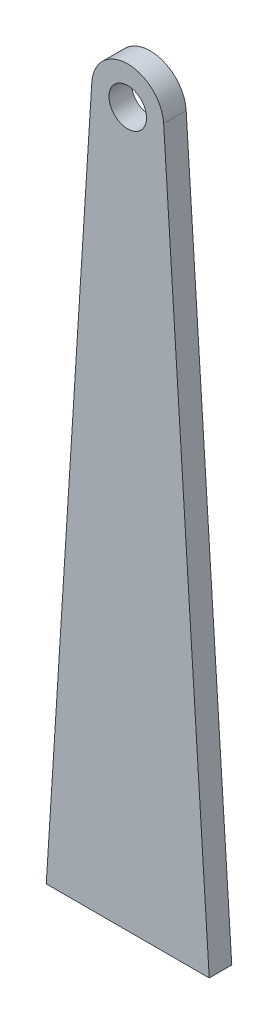
ISO-10303-21;
HEADER;
FILE_DESCRIPTION(('STEP AP214'),'2;1');
FILE_NAME('part.step','',(''),(''),'','','');
FILE_SCHEMA(('AUTOMOTIVE_DESIGN { 1 0 10303 214 1 1 1 1 }'));
ENDSEC;
DATA;
#1=APPLICATION_CONTEXT('core data for automotive mechanical design processes');
#2=APPLICATION_PROTOCOL_DEFINITION('international standard','automotive_design',2000,#1);
#3=PRODUCT_CONTEXT('',#1,'mechanical');
#4=PRODUCT('Part','Part','',(#3));
#5=PRODUCT_RELATED_PRODUCT_CATEGORY('part','',(#4));
#6=PRODUCT_DEFINITION_FORMATION('','',#4);
#7=PRODUCT_DEFINITION_CONTEXT('part definition',#1,'design');
#8=PRODUCT_DEFINITION('design','',#6,#7);
#9=PRODUCT_DEFINITION_SHAPE('','',#8);
#10=(LENGTH_UNIT() NAMED_UNIT(*) SI_UNIT(.MILLI.,.METRE.));
#11=(NAMED_UNIT(*) PLANE_ANGLE_UNIT() SI_UNIT($,.RADIAN.));
#12=(NAMED_UNIT(*) SI_UNIT($,.STERADIAN.) SOLID_ANGLE_UNIT());
#13=UNCERTAINTY_MEASURE_WITH_UNIT(LENGTH_MEASURE(1.E-05),#10,'distance_accuracy_value','');
#14=(GEOMETRIC_REPRESENTATION_CONTEXT(3) GLOBAL_UNCERTAINTY_ASSIGNED_CONTEXT((#13)) GLOBAL_UNIT_ASSIGNED_CONTEXT((#10,
#11,#12)) REPRESENTATION_CONTEXT('',''));
#15=CARTESIAN_POINT('',(0.,0.,0.));
#16=DIRECTION('',(0.,0.,1.));
#17=DIRECTION('',(1.,0.,0.));
#18=AXIS2_PLACEMENT_3D('',#15,#16,#17);
#19=CARTESIAN_POINT('',(0.,10.3024896690877,3.));
#20=DIRECTION('',(0.,0.,-1.));
#21=DIRECTION('',(-1.,0.,0.));
#22=AXIS2_PLACEMENT_3D('',#19,#20,#21);
#23=PLANE('',#22);
#24=DIRECTION('',(-0.0634393515273063,-0.997985695627846,0.));
#25=VECTOR('',#24,1.);
#26=CARTESIAN_POINT('',(-10.8535639513607,-84.9057582701911,3.));
#27=LINE('',#26,#25);
#28=CARTESIAN_POINT('',(-4.78210001359501,10.6064753124995,3.));
#29=VERTEX_POINT('',#28);
#30=CARTESIAN_POINT('',(-10.8535639513607,-84.9057582701911,3.));
#31=VERTEX_POINT('',#30);
#32=EDGE_CURVE('E86',#29,#31,#27,.T.);
#33=ORIENTED_EDGE('',*,*,#32,.T.);
#34=DIRECTION('',(1.,0.,0.));
#35=VECTOR('',#34,1.);
#36=CARTESIAN_POINT('',(10.8535639513607,-84.9057582701911,3.));
#37=LINE('',#36,#35);
#38=CARTESIAN_POINT('',(10.8535639513607,-84.9057582701911,3.));
#39=VERTEX_POINT('',#38);
#40=EDGE_CURVE('E80',#31,#39,#37,.T.);
#41=ORIENTED_EDGE('',*,*,#40,.T.);
#42=DIRECTION('',(-0.0634393515273063,0.997985695627846,0.));
#43=VECTOR('',#42,1.);
#44=CARTESIAN_POINT('',(10.8535639513607,-84.9057582701911,3.));
#45=LINE('',#44,#43);
#46=CARTESIAN_POINT('',(4.78210001359501,10.6064753124995,3.));
#47=VERTEX_POINT('',#46);
#48=EDGE_CURVE('E83',#39,#47,#45,.T.);
#49=ORIENTED_EDGE('',*,*,#48,.T.);
#50=CARTESIAN_POINT('',(0.,10.3024896690877,3.));
#51=DIRECTION('',(0.,0.,1.));
#52=DIRECTION('',(1.,0.,0.));
#53=AXIS2_PLACEMENT_3D('',#50,#51,#52);
#54=CIRCLE('',#53,4.7917520607212);
#55=EDGE_CURVE('E52',#47,#29,#54,.T.);
#56=ORIENTED_EDGE('',*,*,#55,.T.);
#57=EDGE_LOOP('',(#33,#41,#49,#56));
#58=FACE_BOUND('',#57,.T.);
#59=CARTESIAN_POINT('',(0.,10.0942417298089,3.));
#60=DIRECTION('',(0.,0.,1.));
#61=DIRECTION('',(1.,0.,0.));
#62=AXIS2_PLACEMENT_3D('',#59,#60,#61);
#63=CIRCLE('',#62,2.5);
#64=CARTESIAN_POINT('',(2.5,10.0942417298089,3.));
#65=VERTEX_POINT('',#64);
#66=EDGE_CURVE('E103',#65,#65,#63,.T.);
#67=ORIENTED_EDGE('',*,*,#66,.F.);
#68=EDGE_LOOP('',(#67));
#69=FACE_BOUND('',#68,.T.);
#70=ADVANCED_FACE('F35',(#58,#69),#23,.F.);
#71=CARTESIAN_POINT('',(0.,10.3024896690877,0.));
#72=DIRECTION('',(0.,0.,-1.));
#73=DIRECTION('',(-1.,0.,0.));
#74=AXIS2_PLACEMENT_3D('',#71,#72,#73);
#75=PLANE('',#74);
#76=DIRECTION('',(-0.0634393515273063,-0.997985695627846,0.));
#77=VECTOR('',#76,1.);
#78=CARTESIAN_POINT('',(-10.8535639513607,-84.9057582701911,0.));
#79=LINE('',#78,#77);
#80=CARTESIAN_POINT('',(-4.78210001359501,10.6064753124995,0.));
#81=VERTEX_POINT('',#80);
#82=CARTESIAN_POINT('',(-10.8535639513607,-84.9057582701911,0.));
#83=VERTEX_POINT('',#82);
#84=EDGE_CURVE('E100',#81,#83,#79,.T.);
#85=ORIENTED_EDGE('',*,*,#84,.F.);
#86=CARTESIAN_POINT('',(0.,10.3024896690877,0.));
#87=DIRECTION('',(0.,0.,1.));
#88=DIRECTION('',(-1.,0.,0.));
#89=AXIS2_PLACEMENT_3D('',#86,#87,#88);
#90=CIRCLE('',#89,4.7917520607212);
#91=CARTESIAN_POINT('',(4.78210001359501,10.6064753124995,0.));
#92=VERTEX_POINT('',#91);
#93=EDGE_CURVE('E69',#92,#81,#90,.T.);
#94=ORIENTED_EDGE('',*,*,#93,.F.);
#95=DIRECTION('',(-0.0634393515273063,0.997985695627846,0.));
#96=VECTOR('',#95,1.);
#97=CARTESIAN_POINT('',(10.8535639513607,-84.9057582701911,0.));
#98=LINE('',#97,#96);
#99=CARTESIAN_POINT('',(10.8535639513607,-84.9057582701911,0.));
#100=VERTEX_POINT('',#99);
#101=EDGE_CURVE('E105',#100,#92,#98,.T.);
#102=ORIENTED_EDGE('',*,*,#101,.F.);
#103=DIRECTION('',(1.,0.,0.));
#104=VECTOR('',#103,1.);
#105=CARTESIAN_POINT('',(10.8535639513607,-84.9057582701911,0.));
#106=LINE('',#105,#104);
#107=EDGE_CURVE('E91',#83,#100,#106,.T.);
#108=ORIENTED_EDGE('',*,*,#107,.F.);
#109=EDGE_LOOP('',(#85,#94,#102,#108));
#110=FACE_BOUND('',#109,.T.);
#111=CARTESIAN_POINT('',(0.,10.0942417298089,0.));
#112=DIRECTION('',(0.,0.,1.));
#113=DIRECTION('',(1.,0.,0.));
#114=AXIS2_PLACEMENT_3D('',#111,#112,#113);
#115=CIRCLE('',#114,2.5);
#116=CARTESIAN_POINT('',(2.5,10.0942417298089,0.));
#117=VERTEX_POINT('',#116);
#118=EDGE_CURVE('E112',#117,#117,#115,.T.);
#119=ORIENTED_EDGE('',*,*,#118,.T.);
#120=EDGE_LOOP('',(#119));
#121=FACE_BOUND('',#120,.T.);
#122=ADVANCED_FACE('F121',(#110,#121),#75,.T.);
#123=CARTESIAN_POINT('',(-10.8535639513607,-84.9057582701911,3.));
#124=DIRECTION('',(0.997985695627845,-0.0634393515273063,0.));
#125=DIRECTION('',(0.0634393515273063,0.997985695627846,0.));
#126=AXIS2_PLACEMENT_3D('',#123,#124,#125);
#127=PLANE('',#126);
#128=ORIENTED_EDGE('',*,*,#84,.T.);
#129=DIRECTION('',(0.,0.,-1.));
#130=VECTOR('',#129,1.);
#131=CARTESIAN_POINT('',(-10.8535639513607,-84.9057582701911,3.));
#132=LINE('',#131,#130);
#133=EDGE_CURVE('E11',#31,#83,#132,.T.);
#134=ORIENTED_EDGE('',*,*,#133,.F.);
#135=ORIENTED_EDGE('',*,*,#32,.F.);
#136=DIRECTION('',(0.,0.,-1.));
#137=VECTOR('',#136,1.);
#138=CARTESIAN_POINT('',(-4.78210001359501,10.6064753124995,3.));
#139=LINE('',#138,#137);
#140=EDGE_CURVE('E96',#29,#81,#139,.T.);
#141=ORIENTED_EDGE('',*,*,#140,.T.);
#142=EDGE_LOOP('',(#128,#134,#135,#141));
#143=FACE_BOUND('',#142,.T.);
#144=ADVANCED_FACE('F37',(#143),#127,.F.);
#145=CARTESIAN_POINT('',(10.8535639513607,-84.9057582701911,3.));
#146=DIRECTION('',(0.,1.,0.));
#147=DIRECTION('',(0.,0.,1.));
#148=AXIS2_PLACEMENT_3D('',#145,#146,#147);
#149=PLANE('',#148);
#150=ORIENTED_EDGE('',*,*,#107,.T.);
#151=DIRECTION('',(0.,0.,-1.));
#152=VECTOR('',#151,1.);
#153=CARTESIAN_POINT('',(10.8535639513607,-84.9057582701911,3.));
#154=LINE('',#153,#152);
#155=EDGE_CURVE('E44',#39,#100,#154,.T.);
#156=ORIENTED_EDGE('',*,*,#155,.F.);
#157=ORIENTED_EDGE('',*,*,#40,.F.);
#158=ORIENTED_EDGE('',*,*,#133,.T.);
#159=EDGE_LOOP('',(#150,#156,#157,#158));
#160=FACE_BOUND('',#159,.T.);
#161=ADVANCED_FACE('F90',(#160),#149,.F.);
#162=CARTESIAN_POINT('',(10.8535639513607,-84.9057582701911,3.));
#163=DIRECTION('',(-0.997985695627845,-0.0634393515273063,0.));
#164=DIRECTION('',(0.0634393515273063,-0.997985695627846,0.));
#165=AXIS2_PLACEMENT_3D('',#162,#163,#164);
#166=PLANE('',#165);
#167=ORIENTED_EDGE('',*,*,#101,.T.);
#168=DIRECTION('',(0.,0.,-1.));
#169=VECTOR('',#168,1.);
#170=CARTESIAN_POINT('',(4.78210001359501,10.6064753124995,3.));
#171=LINE('',#170,#169);
#172=EDGE_CURVE('E93',#47,#92,#171,.T.);
#173=ORIENTED_EDGE('',*,*,#172,.F.);
#174=ORIENTED_EDGE('',*,*,#48,.F.);
#175=ORIENTED_EDGE('',*,*,#155,.T.);
#176=EDGE_LOOP('',(#167,#173,#174,#175));
#177=FACE_BOUND('',#176,.T.);
#178=ADVANCED_FACE('F94',(#177),#166,.F.);
#179=CARTESIAN_POINT('',(0.,10.3024896690877,3.));
#180=DIRECTION('',(0.,0.,-1.));
#181=DIRECTION('',(-1.,0.,0.));
#182=AXIS2_PLACEMENT_3D('',#179,#180,#181);
#183=CYLINDRICAL_SURFACE('',#182,4.7917520607212);
#184=ORIENTED_EDGE('',*,*,#93,.T.);
#185=ORIENTED_EDGE('',*,*,#140,.F.);
#186=ORIENTED_EDGE('',*,*,#55,.F.);
#187=ORIENTED_EDGE('',*,*,#172,.T.);
#188=EDGE_LOOP('',(#184,#185,#186,#187));
#189=FACE_BOUND('',#188,.T.);
#190=ADVANCED_FACE('F109',(#189),#183,.T.);
#191=CARTESIAN_POINT('',(0.,10.0942417298089,3.));
#192=DIRECTION('',(0.,0.,-1.));
#193=DIRECTION('',(-1.,0.,0.));
#194=AXIS2_PLACEMENT_3D('',#191,#192,#193);
#195=CYLINDRICAL_SURFACE('',#194,2.5);
#196=ORIENTED_EDGE('',*,*,#66,.T.);
#197=EDGE_LOOP('',(#196));
#198=FACE_BOUND('',#197,.T.);
#199=ORIENTED_EDGE('',*,*,#118,.F.);
#200=EDGE_LOOP('',(#199));
#201=FACE_BOUND('',#200,.T.);
#202=ADVANCED_FACE('F118',(#198,#201),#195,.F.);
#203=CLOSED_SHELL('',(#70,#122,#144,#161,#178,#190,#202));
#204=MANIFOLD_SOLID_BREP('B2',#203);
#205=ADVANCED_BREP_SHAPE_REPRESENTATION('',(#18,#204),#14);
#206=SHAPE_DEFINITION_REPRESENTATION(#9,#205);
ENDSEC;
END-ISO-10303-21;
